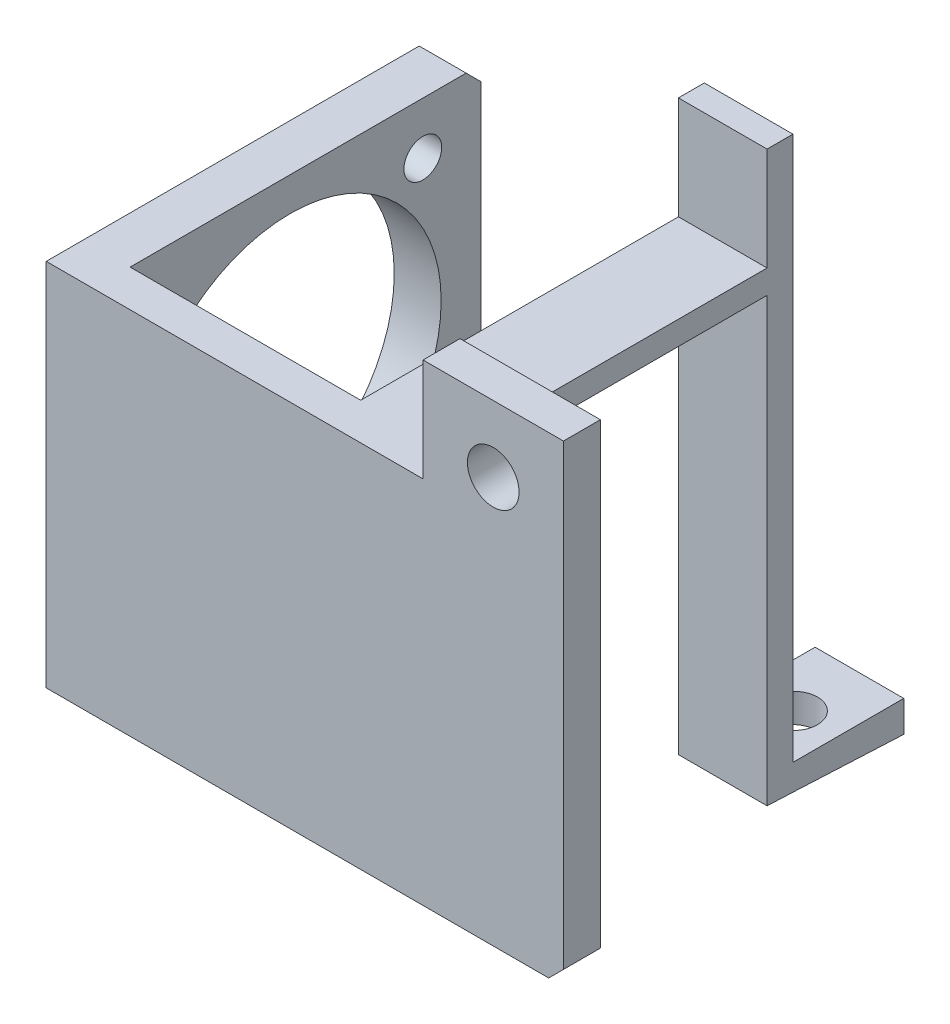
ISO-10303-21;
HEADER;
FILE_DESCRIPTION(('STEP AP214'),'2;1');
FILE_NAME('part.step','',(''),(''),'','','');
FILE_SCHEMA(('AUTOMOTIVE_DESIGN { 1 0 10303 214 1 1 1 1 }'));
ENDSEC;
DATA;
#1=APPLICATION_CONTEXT('core data for automotive mechanical design processes');
#2=APPLICATION_PROTOCOL_DEFINITION('international standard','automotive_design',2000,#1);
#3=PRODUCT_CONTEXT('',#1,'mechanical');
#4=PRODUCT('Part','Part','',(#3));
#5=PRODUCT_RELATED_PRODUCT_CATEGORY('part','',(#4));
#6=PRODUCT_DEFINITION_FORMATION('','',#4);
#7=PRODUCT_DEFINITION_CONTEXT('part definition',#1,'design');
#8=PRODUCT_DEFINITION('design','',#6,#7);
#9=PRODUCT_DEFINITION_SHAPE('','',#8);
#10=(LENGTH_UNIT() NAMED_UNIT(*) SI_UNIT(.MILLI.,.METRE.));
#11=(NAMED_UNIT(*) PLANE_ANGLE_UNIT() SI_UNIT($,.RADIAN.));
#12=(NAMED_UNIT(*) SI_UNIT($,.STERADIAN.) SOLID_ANGLE_UNIT());
#13=UNCERTAINTY_MEASURE_WITH_UNIT(LENGTH_MEASURE(1.E-05),#10,'distance_accuracy_value','');
#14=(GEOMETRIC_REPRESENTATION_CONTEXT(3) GLOBAL_UNCERTAINTY_ASSIGNED_CONTEXT((#13)) GLOBAL_UNIT_ASSIGNED_CONTEXT((#10,
#11,#12)) REPRESENTATION_CONTEXT('',''));
#15=CARTESIAN_POINT('',(0.,0.,0.));
#16=DIRECTION('',(0.,0.,1.));
#17=DIRECTION('',(1.,0.,0.));
#18=AXIS2_PLACEMENT_3D('',#15,#16,#17);
#19=CARTESIAN_POINT('',(51.,-27.8779702218171,5.));
#20=DIRECTION('',(0.,1.,0.));
#21=DIRECTION('',(-1.,0.,0.));
#22=AXIS2_PLACEMENT_3D('',#19,#20,#21);
#23=PLANE('',#22);
#24=DIRECTION('',(0.,0.,1.));
#25=VECTOR('',#24,1.);
#26=CARTESIAN_POINT('',(6.35,-27.8779702218171,-52.48));
#27=LINE('',#26,#25);
#28=CARTESIAN_POINT('',(6.35,-27.8779702218171,-45.48));
#29=VERTEX_POINT('',#28);
#30=CARTESIAN_POINT('',(6.35000000000001,-27.8779702218171,0.));
#31=VERTEX_POINT('',#30);
#32=EDGE_CURVE('E310',#29,#31,#27,.T.);
#33=ORIENTED_EDGE('',*,*,#32,.F.);
#34=DIRECTION('',(-1.,0.,0.));
#35=VECTOR('',#34,1.);
#36=CARTESIAN_POINT('',(51.,-27.8779702218171,-45.48));
#37=LINE('',#36,#35);
#38=CARTESIAN_POINT('',(0.,-27.8779702218171,-45.48));
#39=VERTEX_POINT('',#38);
#40=EDGE_CURVE('E246',#29,#39,#37,.T.);
#41=ORIENTED_EDGE('',*,*,#40,.T.);
#42=DIRECTION('',(0.,0.,-1.));
#43=VECTOR('',#42,1.);
#44=CARTESIAN_POINT('',(0.,-27.8779702218171,5.));
#45=LINE('',#44,#43);
#46=CARTESIAN_POINT('',(0.,-27.8779702218171,5.));
#47=VERTEX_POINT('',#46);
#48=EDGE_CURVE('E333',#47,#39,#45,.T.);
#49=ORIENTED_EDGE('',*,*,#48,.F.);
#50=DIRECTION('',(1.,0.,0.));
#51=VECTOR('',#50,1.);
#52=CARTESIAN_POINT('',(51.,-27.8779702218171,5.));
#53=LINE('',#52,#51);
#54=CARTESIAN_POINT('',(51.,-27.8779702218171,5.));
#55=VERTEX_POINT('',#54);
#56=EDGE_CURVE('E313',#47,#55,#53,.T.);
#57=ORIENTED_EDGE('',*,*,#56,.T.);
#58=DIRECTION('',(0.,0.,-1.));
#59=VECTOR('',#58,1.);
#60=CARTESIAN_POINT('',(51.,-27.8779702218171,5.));
#61=LINE('',#60,#59);
#62=CARTESIAN_POINT('',(51.,-27.8779702218171,0.));
#63=VERTEX_POINT('',#62);
#64=EDGE_CURVE('E322',#55,#63,#61,.T.);
#65=ORIENTED_EDGE('',*,*,#64,.T.);
#66=DIRECTION('',(1.,0.,0.));
#67=VECTOR('',#66,1.);
#68=CARTESIAN_POINT('',(51.,-27.8779702218171,0.));
#69=LINE('',#68,#67);
#70=CARTESIAN_POINT('',(49.56,-27.8779702218171,0.));
#71=VERTEX_POINT('',#70);
#72=EDGE_CURVE('E312',#71,#63,#69,.T.);
#73=ORIENTED_EDGE('',*,*,#72,.F.);
#74=DIRECTION('',(0.,0.,1.));
#75=VECTOR('',#74,1.);
#76=CARTESIAN_POINT('',(49.56,-27.8779702218171,-46.5));
#77=LINE('',#76,#75);
#78=CARTESIAN_POINT('',(49.56,-27.8779702218171,-43.));
#79=VERTEX_POINT('',#78);
#80=EDGE_CURVE('E272',#79,#71,#77,.T.);
#81=ORIENTED_EDGE('',*,*,#80,.F.);
#82=DIRECTION('',(-1.,0.,0.));
#83=VECTOR('',#82,1.);
#84=CARTESIAN_POINT('',(51.,-27.8779702218171,-43.));
#85=LINE('',#84,#83);
#86=CARTESIAN_POINT('',(37.56,-27.8779702218171,-43.));
#87=VERTEX_POINT('',#86);
#88=EDGE_CURVE('E391',#79,#87,#85,.T.);
#89=ORIENTED_EDGE('',*,*,#88,.T.);
#90=DIRECTION('',(0.,0.,1.));
#91=VECTOR('',#90,1.);
#92=CARTESIAN_POINT('',(37.56,-27.8779702218171,-46.5));
#93=LINE('',#92,#91);
#94=CARTESIAN_POINT('',(37.56,-27.8779702218171,0.));
#95=VERTEX_POINT('',#94);
#96=EDGE_CURVE('E268',#87,#95,#93,.T.);
#97=ORIENTED_EDGE('',*,*,#96,.T.);
#98=EDGE_CURVE('E323',#31,#95,#69,.T.);
#99=ORIENTED_EDGE('',*,*,#98,.F.);
#100=EDGE_LOOP('',(#33,#41,#49,#57,#65,#73,#81,#89,#97,#99));
#101=FACE_BOUND('',#100,.T.);
#102=ADVANCED_FACE('F43',(#101),#23,.T.);
#103=CARTESIAN_POINT('',(0.,0.,0.));
#104=DIRECTION('',(0.,0.,-1.));
#105=DIRECTION('',(-1.,0.,0.));
#106=AXIS2_PLACEMENT_3D('',#103,#104,#105);
#107=PLANE('',#106);
#108=DIRECTION('',(-1.,0.,0.));
#109=VECTOR('',#108,1.);
#110=CARTESIAN_POINT('',(0.,-13.9389851109086,0.));
#111=LINE('',#110,#109);
#112=CARTESIAN_POINT('',(70.,-13.9389851109086,0.));
#113=VERTEX_POINT('',#112);
#114=CARTESIAN_POINT('',(51.,-13.9389851109085,0.));
#115=VERTEX_POINT('',#114);
#116=EDGE_CURVE('E59',#113,#115,#111,.T.);
#117=ORIENTED_EDGE('',*,*,#116,.F.);
#118=DIRECTION('',(0.,1.,0.));
#119=VECTOR('',#118,1.);
#120=CARTESIAN_POINT('',(70.,64.0610148890915,0.));
#121=LINE('',#120,#119);
#122=CARTESIAN_POINT('',(70.,-75.8779702218171,0.));
#123=VERTEX_POINT('',#122);
#124=EDGE_CURVE('E207',#123,#113,#121,.T.);
#125=ORIENTED_EDGE('',*,*,#124,.F.);
#126=DIRECTION('',(-0.707106781186548,-0.707106781186548,0.));
#127=VECTOR('',#126,1.);
#128=CARTESIAN_POINT('',(72.9389851109086,-72.9389851109086,0.));
#129=LINE('',#128,#127);
#130=CARTESIAN_POINT('',(68.0000000000001,-77.8779702218171,0.));
#131=VERTEX_POINT('',#130);
#132=EDGE_CURVE('E217',#123,#131,#129,.T.);
#133=ORIENTED_EDGE('',*,*,#132,.T.);
#134=DIRECTION('',(-1.,0.,0.));
#135=VECTOR('',#134,1.);
#136=CARTESIAN_POINT('',(0.,-77.8779702218171,0.));
#137=LINE('',#136,#135);
#138=CARTESIAN_POINT('',(6.35000000000001,-77.8779702218171,0.));
#139=VERTEX_POINT('',#138);
#140=EDGE_CURVE('E317',#131,#139,#137,.T.);
#141=ORIENTED_EDGE('',*,*,#140,.T.);
#142=DIRECTION('',(0.,1.,0.));
#143=VECTOR('',#142,1.);
#144=CARTESIAN_POINT('',(6.35,-27.8779702218171,0.));
#145=LINE('',#144,#143);
#146=EDGE_CURVE('E305',#139,#31,#145,.T.);
#147=ORIENTED_EDGE('',*,*,#146,.T.);
#148=ORIENTED_EDGE('',*,*,#98,.T.);
#149=DIRECTION('',(0.,-1.,0.));
#150=VECTOR('',#149,1.);
#151=CARTESIAN_POINT('',(37.56,-27.8779702218171,0.));
#152=LINE('',#151,#150);
#153=CARTESIAN_POINT('',(37.56,-31.0779702218171,0.));
#154=VERTEX_POINT('',#153);
#155=EDGE_CURVE('E399',#95,#154,#152,.T.);
#156=ORIENTED_EDGE('',*,*,#155,.T.);
#157=DIRECTION('',(1.,0.,0.));
#158=VECTOR('',#157,1.);
#159=CARTESIAN_POINT('',(49.56,-31.0779702218171,0.));
#160=LINE('',#159,#158);
#161=CARTESIAN_POINT('',(49.56,-31.0779702218171,0.));
#162=VERTEX_POINT('',#161);
#163=EDGE_CURVE('E263',#154,#162,#160,.T.);
#164=ORIENTED_EDGE('',*,*,#163,.T.);
#165=DIRECTION('',(0.,1.,0.));
#166=VECTOR('',#165,1.);
#167=CARTESIAN_POINT('',(49.56,-27.8779702218171,0.));
#168=LINE('',#167,#166);
#169=EDGE_CURVE('E395',#162,#71,#168,.T.);
#170=ORIENTED_EDGE('',*,*,#169,.T.);
#171=ORIENTED_EDGE('',*,*,#72,.T.);
#172=DIRECTION('',(0.,-1.,0.));
#173=VECTOR('',#172,1.);
#174=CARTESIAN_POINT('',(51.,-13.9389851109085,0.));
#175=LINE('',#174,#173);
#176=EDGE_CURVE('E222',#115,#63,#175,.T.);
#177=ORIENTED_EDGE('',*,*,#176,.F.);
#178=EDGE_LOOP('',(#117,#125,#133,#141,#147,#148,#156,#164,#170,#171,#177));
#179=FACE_BOUND('',#178,.T.);
#180=CARTESIAN_POINT('',(60.5,-22.9389851109085,0.));
#181=DIRECTION('',(0.,0.,1.));
#182=DIRECTION('',(-1.,0.,0.));
#183=AXIS2_PLACEMENT_3D('',#180,#181,#182);
#184=CIRCLE('',#183,3.5);
#185=CARTESIAN_POINT('',(57.,-22.9389851109085,0.));
#186=VERTEX_POINT('',#185);
#187=EDGE_CURVE('E276',#186,#186,#184,.T.);
#188=ORIENTED_EDGE('',*,*,#187,.T.);
#189=EDGE_LOOP('',(#188));
#190=FACE_BOUND('',#189,.T.);
#191=ADVANCED_FACE('F414',(#179,#190),#107,.T.);
#192=CARTESIAN_POINT('',(70.,64.0610148890915,5.));
#193=DIRECTION('',(-1.,0.,0.));
#194=DIRECTION('',(0.,-1.,0.));
#195=AXIS2_PLACEMENT_3D('',#192,#193,#194);
#196=PLANE('',#195);
#197=ORIENTED_EDGE('',*,*,#124,.T.);
#198=DIRECTION('',(0.,0.,-1.));
#199=VECTOR('',#198,1.);
#200=CARTESIAN_POINT('',(70.,-13.9389851109086,5.));
#201=LINE('',#200,#199);
#202=CARTESIAN_POINT('',(70.,-13.9389851109086,5.));
#203=VERTEX_POINT('',#202);
#204=EDGE_CURVE('E193',#203,#113,#201,.T.);
#205=ORIENTED_EDGE('',*,*,#204,.F.);
#206=DIRECTION('',(0.,1.,0.));
#207=VECTOR('',#206,1.);
#208=CARTESIAN_POINT('',(70.,64.0610148890915,5.));
#209=LINE('',#208,#207);
#210=CARTESIAN_POINT('',(70.,-75.8779702218171,5.));
#211=VERTEX_POINT('',#210);
#212=EDGE_CURVE('E204',#211,#203,#209,.T.);
#213=ORIENTED_EDGE('',*,*,#212,.F.);
#214=DIRECTION('',(0.,0.,-1.));
#215=VECTOR('',#214,1.);
#216=CARTESIAN_POINT('',(70.,-75.8779702218171,0.));
#217=LINE('',#216,#215);
#218=EDGE_CURVE('E214',#211,#123,#217,.T.);
#219=ORIENTED_EDGE('',*,*,#218,.T.);
#220=EDGE_LOOP('',(#197,#205,#213,#219));
#221=FACE_BOUND('',#220,.T.);
#222=ADVANCED_FACE('F202',(#221),#196,.F.);
#223=CARTESIAN_POINT('',(0.,0.,5.));
#224=DIRECTION('',(0.,0.,-1.));
#225=DIRECTION('',(-1.,0.,0.));
#226=AXIS2_PLACEMENT_3D('',#223,#224,#225);
#227=PLANE('',#226);
#228=CARTESIAN_POINT('',(60.5,-22.9389851109085,5.));
#229=DIRECTION('',(0.,0.,-1.));
#230=DIRECTION('',(-1.,0.,0.));
#231=AXIS2_PLACEMENT_3D('',#228,#229,#230);
#232=CIRCLE('',#231,3.5);
#233=CARTESIAN_POINT('',(57.,-22.9389851109085,5.));
#234=VERTEX_POINT('',#233);
#235=EDGE_CURVE('E270',#234,#234,#232,.T.);
#236=ORIENTED_EDGE('',*,*,#235,.T.);
#237=EDGE_LOOP('',(#236));
#238=FACE_BOUND('',#237,.T.);
#239=ORIENTED_EDGE('',*,*,#212,.T.);
#240=DIRECTION('',(1.,0.,0.));
#241=VECTOR('',#240,1.);
#242=CARTESIAN_POINT('',(-159.731110219777,-13.9389851109086,5.));
#243=LINE('',#242,#241);
#244=CARTESIAN_POINT('',(51.,-13.9389851109086,5.));
#245=VERTEX_POINT('',#244);
#246=EDGE_CURVE('E190',#245,#203,#243,.T.);
#247=ORIENTED_EDGE('',*,*,#246,.F.);
#248=DIRECTION('',(0.,-1.,0.));
#249=VECTOR('',#248,1.);
#250=CARTESIAN_POINT('',(51.,-13.9389851109085,5.));
#251=LINE('',#250,#249);
#252=EDGE_CURVE('E215',#245,#55,#251,.T.);
#253=ORIENTED_EDGE('',*,*,#252,.T.);
#254=ORIENTED_EDGE('',*,*,#56,.F.);
#255=DIRECTION('',(0.,1.,0.));
#256=VECTOR('',#255,1.);
#257=CARTESIAN_POINT('',(0.,-27.8779702218171,5.));
#258=LINE('',#257,#256);
#259=CARTESIAN_POINT('',(0.,-77.8779702218171,5.));
#260=VERTEX_POINT('',#259);
#261=EDGE_CURVE('E316',#260,#47,#258,.T.);
#262=ORIENTED_EDGE('',*,*,#261,.F.);
#263=DIRECTION('',(-1.,0.,0.));
#264=VECTOR('',#263,1.);
#265=CARTESIAN_POINT('',(0.,-77.8779702218171,5.));
#266=LINE('',#265,#264);
#267=CARTESIAN_POINT('',(68.0000000000001,-77.8779702218171,5.));
#268=VERTEX_POINT('',#267);
#269=EDGE_CURVE('E320',#268,#260,#266,.T.);
#270=ORIENTED_EDGE('',*,*,#269,.F.);
#271=DIRECTION('',(0.707106781186548,0.707106781186548,0.));
#272=VECTOR('',#271,1.);
#273=CARTESIAN_POINT('',(70.,-75.8779702218171,5.));
#274=LINE('',#273,#272);
#275=EDGE_CURVE('E213',#268,#211,#274,.T.);
#276=ORIENTED_EDGE('',*,*,#275,.T.);
#277=EDGE_LOOP('',(#239,#247,#253,#254,#262,#270,#276));
#278=FACE_BOUND('',#277,.T.);
#279=ADVANCED_FACE('F210',(#238,#278),#227,.F.);
#280=CARTESIAN_POINT('',(0.,-77.8779702218171,5.));
#281=DIRECTION('',(0.,-1.,0.));
#282=DIRECTION('',(1.,0.,0.));
#283=AXIS2_PLACEMENT_3D('',#280,#281,#282);
#284=PLANE('',#283);
#285=ORIENTED_EDGE('',*,*,#140,.F.);
#286=DIRECTION('',(0.,0.,1.));
#287=VECTOR('',#286,1.);
#288=CARTESIAN_POINT('',(68.0000000000001,-77.8779702218171,5.));
#289=LINE('',#288,#287);
#290=EDGE_CURVE('E230',#131,#268,#289,.T.);
#291=ORIENTED_EDGE('',*,*,#290,.T.);
#292=ORIENTED_EDGE('',*,*,#269,.T.);
#293=DIRECTION('',(0.,0.,-1.));
#294=VECTOR('',#293,1.);
#295=CARTESIAN_POINT('',(0.,-77.8779702218171,5.));
#296=LINE('',#295,#294);
#297=CARTESIAN_POINT('',(0.,-77.8779702218171,-45.48));
#298=VERTEX_POINT('',#297);
#299=EDGE_CURVE('E330',#260,#298,#296,.T.);
#300=ORIENTED_EDGE('',*,*,#299,.T.);
#301=DIRECTION('',(1.,0.,0.));
#302=VECTOR('',#301,1.);
#303=CARTESIAN_POINT('',(0.,-77.8779702218171,-45.48));
#304=LINE('',#303,#302);
#305=CARTESIAN_POINT('',(6.35000000000001,-77.8779702218171,-45.48));
#306=VERTEX_POINT('',#305);
#307=EDGE_CURVE('E227',#298,#306,#304,.T.);
#308=ORIENTED_EDGE('',*,*,#307,.T.);
#309=DIRECTION('',(0.,0.,1.));
#310=VECTOR('',#309,1.);
#311=CARTESIAN_POINT('',(6.35000000000001,-77.8779702218171,-52.48));
#312=LINE('',#311,#310);
#313=EDGE_CURVE('E308',#306,#139,#312,.T.);
#314=ORIENTED_EDGE('',*,*,#313,.T.);
#315=EDGE_LOOP('',(#285,#291,#292,#300,#308,#314));
#316=FACE_BOUND('',#315,.T.);
#317=ADVANCED_FACE('F432',(#316),#284,.T.);
#318=CARTESIAN_POINT('',(0.,0.,-46.5));
#319=DIRECTION('',(0.,0.,1.));
#320=DIRECTION('',(1.,0.,0.));
#321=AXIS2_PLACEMENT_3D('',#318,#319,#320);
#322=PLANE('',#321);
#323=DIRECTION('',(0.,1.,0.));
#324=VECTOR('',#323,1.);
#325=CARTESIAN_POINT('',(37.56,0.,-46.5));
#326=LINE('',#325,#324);
#327=CARTESIAN_POINT('',(37.56,-87.5746130747018,-46.5));
#328=VERTEX_POINT('',#327);
#329=CARTESIAN_POINT('',(37.56,-13.9389851109086,-46.5));
#330=VERTEX_POINT('',#329);
#331=EDGE_CURVE('E224',#328,#330,#326,.T.);
#332=ORIENTED_EDGE('',*,*,#331,.T.);
#333=DIRECTION('',(1.,0.,0.));
#334=VECTOR('',#333,1.);
#335=CARTESIAN_POINT('',(0.,-13.9389851109086,-46.5));
#336=LINE('',#335,#334);
#337=CARTESIAN_POINT('',(49.56,-13.9389851109086,-46.5));
#338=VERTEX_POINT('',#337);
#339=EDGE_CURVE('E342',#330,#338,#336,.T.);
#340=ORIENTED_EDGE('',*,*,#339,.T.);
#341=DIRECTION('',(0.,-1.,0.));
#342=VECTOR('',#341,1.);
#343=CARTESIAN_POINT('',(49.56,0.,-46.5));
#344=LINE('',#343,#342);
#345=CARTESIAN_POINT('',(49.5599999999998,-87.5746130747019,-46.5));
#346=VERTEX_POINT('',#345);
#347=EDGE_CURVE('E336',#338,#346,#344,.T.);
#348=ORIENTED_EDGE('',*,*,#347,.T.);
#349=DIRECTION('',(1.,0.,0.));
#350=VECTOR('',#349,1.);
#351=CARTESIAN_POINT('',(-42.4634266051924,-87.5746130747017,-46.5));
#352=LINE('',#351,#350);
#353=EDGE_CURVE('E345',#328,#346,#352,.T.);
#354=ORIENTED_EDGE('',*,*,#353,.F.);
#355=EDGE_LOOP('',(#332,#340,#348,#354));
#356=FACE_BOUND('',#355,.T.);
#357=ADVANCED_FACE('F341',(#356),#322,.F.);
#358=CARTESIAN_POINT('',(51.,-13.9389851109085,5.));
#359=DIRECTION('',(1.,0.,0.));
#360=DIRECTION('',(0.,0.,-1.));
#361=AXIS2_PLACEMENT_3D('',#358,#359,#360);
#362=PLANE('',#361);
#363=ORIENTED_EDGE('',*,*,#252,.F.);
#364=DIRECTION('',(0.,0.,-1.));
#365=VECTOR('',#364,1.);
#366=CARTESIAN_POINT('',(51.,-13.9389851109085,5.));
#367=LINE('',#366,#365);
#368=EDGE_CURVE('E194',#245,#115,#367,.T.);
#369=ORIENTED_EDGE('',*,*,#368,.T.);
#370=ORIENTED_EDGE('',*,*,#176,.T.);
#371=ORIENTED_EDGE('',*,*,#64,.F.);
#372=EDGE_LOOP('',(#363,#369,#370,#371));
#373=FACE_BOUND('',#372,.T.);
#374=ADVANCED_FACE('F426',(#373),#362,.F.);
#375=CARTESIAN_POINT('',(49.56,0.,-46.5));
#376=DIRECTION('',(-1.,0.,0.));
#377=DIRECTION('',(0.,-1.,0.));
#378=AXIS2_PLACEMENT_3D('',#375,#376,#377);
#379=PLANE('',#378);
#380=ORIENTED_EDGE('',*,*,#347,.F.);
#381=DIRECTION('',(0.,0.,1.));
#382=VECTOR('',#381,1.);
#383=CARTESIAN_POINT('',(49.56,-13.9389851109086,-46.5));
#384=LINE('',#383,#382);
#385=CARTESIAN_POINT('',(49.56,-13.9389851109086,-43.));
#386=VERTEX_POINT('',#385);
#387=EDGE_CURVE('E421',#338,#386,#384,.T.);
#388=ORIENTED_EDGE('',*,*,#387,.T.);
#389=DIRECTION('',(0.,-1.,0.));
#390=VECTOR('',#389,1.);
#391=CARTESIAN_POINT('',(49.56,75.6254310840446,-43.));
#392=LINE('',#391,#390);
#393=EDGE_CURVE('E388',#386,#79,#392,.T.);
#394=ORIENTED_EDGE('',*,*,#393,.T.);
#395=ORIENTED_EDGE('',*,*,#80,.T.);
#396=ORIENTED_EDGE('',*,*,#169,.F.);
#397=DIRECTION('',(0.,0.,1.));
#398=VECTOR('',#397,1.);
#399=CARTESIAN_POINT('',(49.56,-31.0779702218171,-46.5));
#400=LINE('',#399,#398);
#401=CARTESIAN_POINT('',(49.5599999999999,-31.0779702218171,-43.));
#402=VERTEX_POINT('',#401);
#403=EDGE_CURVE('E267',#402,#162,#400,.T.);
#404=ORIENTED_EDGE('',*,*,#403,.F.);
#405=DIRECTION('',(0.,-1.,0.));
#406=VECTOR('',#405,1.);
#407=CARTESIAN_POINT('',(49.5599999999998,-90.9199987527818,-43.));
#408=LINE('',#407,#406);
#409=CARTESIAN_POINT('',(49.5599999999998,-90.9199987527818,-43.));
#410=VERTEX_POINT('',#409);
#411=EDGE_CURVE('E256',#402,#410,#408,.T.);
#412=ORIENTED_EDGE('',*,*,#411,.T.);
#413=DIRECTION('',(0.,-0.0441324797854622,-0.999025687471541));
#414=VECTOR('',#413,1.);
#415=CARTESIAN_POINT('',(49.5599999999998,-90.9199987527818,-43.));
#416=LINE('',#415,#414);
#417=CARTESIAN_POINT('',(49.5599999999998,-91.0746130747019,-46.5));
#418=VERTEX_POINT('',#417);
#419=EDGE_CURVE('E379',#410,#418,#416,.T.);
#420=ORIENTED_EDGE('',*,*,#419,.T.);
#421=DIRECTION('',(0.,-0.0479447993683981,-0.99884998684163));
#422=VECTOR('',#421,1.);
#423=CARTESIAN_POINT('',(49.5599999999998,-91.0746130747019,-46.5));
#424=LINE('',#423,#422);
#425=CARTESIAN_POINT('',(49.5599999999998,-91.7946130747019,-61.5));
#426=VERTEX_POINT('',#425);
#427=EDGE_CURVE('E370',#418,#426,#424,.T.);
#428=ORIENTED_EDGE('',*,*,#427,.T.);
#429=DIRECTION('',(0.,1.,0.));
#430=VECTOR('',#429,1.);
#431=CARTESIAN_POINT('',(49.5599999999998,-91.7946130747019,-61.5));
#432=LINE('',#431,#430);
#433=CARTESIAN_POINT('',(49.5599999999998,-87.5746130747019,-61.5));
#434=VERTEX_POINT('',#433);
#435=EDGE_CURVE('E373',#426,#434,#432,.T.);
#436=ORIENTED_EDGE('',*,*,#435,.T.);
#437=DIRECTION('',(0.,0.,1.));
#438=VECTOR('',#437,1.);
#439=CARTESIAN_POINT('',(49.5599999999998,-87.5746130747019,-61.5));
#440=LINE('',#439,#438);
#441=EDGE_CURVE('E376',#434,#346,#440,.T.);
#442=ORIENTED_EDGE('',*,*,#441,.T.);
#443=EDGE_LOOP('',(#380,#388,#394,#395,#396,#404,#412,#420,#428,#436,#442));
#444=FACE_BOUND('',#443,.T.);
#445=ADVANCED_FACE('F404',(#444),#379,.F.);
#446=CARTESIAN_POINT('',(37.56,0.,-46.5));
#447=DIRECTION('',(1.,0.,0.));
#448=DIRECTION('',(0.,0.,-1.));
#449=AXIS2_PLACEMENT_3D('',#446,#447,#448);
#450=PLANE('',#449);
#451=DIRECTION('',(0.,-1.,0.));
#452=VECTOR('',#451,1.);
#453=CARTESIAN_POINT('',(37.56,75.6254310840446,-43.));
#454=LINE('',#453,#452);
#455=CARTESIAN_POINT('',(37.56,-13.9389851109086,-43.));
#456=VERTEX_POINT('',#455);
#457=EDGE_CURVE('E389',#456,#87,#454,.T.);
#458=ORIENTED_EDGE('',*,*,#457,.F.);
#459=DIRECTION('',(0.,0.,-1.));
#460=VECTOR('',#459,1.);
#461=CARTESIAN_POINT('',(37.56,-13.9389851109086,-46.5));
#462=LINE('',#461,#460);
#463=EDGE_CURVE('E67',#456,#330,#462,.T.);
#464=ORIENTED_EDGE('',*,*,#463,.T.);
#465=ORIENTED_EDGE('',*,*,#331,.F.);
#466=DIRECTION('',(0.,0.,-1.));
#467=VECTOR('',#466,1.);
#468=CARTESIAN_POINT('',(37.56,-87.5746130747018,-61.5));
#469=LINE('',#468,#467);
#470=CARTESIAN_POINT('',(37.56,-87.5746130747018,-61.5));
#471=VERTEX_POINT('',#470);
#472=EDGE_CURVE('E349',#328,#471,#469,.T.);
#473=ORIENTED_EDGE('',*,*,#472,.T.);
#474=DIRECTION('',(0.,-1.,0.));
#475=VECTOR('',#474,1.);
#476=CARTESIAN_POINT('',(37.56,-91.7946130747017,-61.5));
#477=LINE('',#476,#475);
#478=CARTESIAN_POINT('',(37.56,-91.7946130747019,-61.5));
#479=VERTEX_POINT('',#478);
#480=EDGE_CURVE('E369',#471,#479,#477,.T.);
#481=ORIENTED_EDGE('',*,*,#480,.T.);
#482=DIRECTION('',(0.,0.0479447993683981,0.99884998684163));
#483=VECTOR('',#482,1.);
#484=CARTESIAN_POINT('',(37.56,-91.0746130747019,-46.5));
#485=LINE('',#484,#483);
#486=CARTESIAN_POINT('',(37.56,-91.0746130747019,-46.5));
#487=VERTEX_POINT('',#486);
#488=EDGE_CURVE('E367',#479,#487,#485,.T.);
#489=ORIENTED_EDGE('',*,*,#488,.T.);
#490=DIRECTION('',(0.,0.0441324797854622,0.999025687471541));
#491=VECTOR('',#490,1.);
#492=CARTESIAN_POINT('',(37.56,-90.9199987527818,-43.));
#493=LINE('',#492,#491);
#494=CARTESIAN_POINT('',(37.56,-90.9199987527818,-43.));
#495=VERTEX_POINT('',#494);
#496=EDGE_CURVE('E359',#487,#495,#493,.T.);
#497=ORIENTED_EDGE('',*,*,#496,.T.);
#498=DIRECTION('',(0.,1.,0.));
#499=VECTOR('',#498,1.);
#500=CARTESIAN_POINT('',(37.56,-90.9199987527816,-43.));
#501=LINE('',#500,#499);
#502=CARTESIAN_POINT('',(37.56,-31.0779702218171,-43.));
#503=VERTEX_POINT('',#502);
#504=EDGE_CURVE('E254',#495,#503,#501,.T.);
#505=ORIENTED_EDGE('',*,*,#504,.T.);
#506=DIRECTION('',(0.,0.,1.));
#507=VECTOR('',#506,1.);
#508=CARTESIAN_POINT('',(37.56,-31.0779702218171,-46.5));
#509=LINE('',#508,#507);
#510=EDGE_CURVE('E260',#503,#154,#509,.T.);
#511=ORIENTED_EDGE('',*,*,#510,.T.);
#512=ORIENTED_EDGE('',*,*,#155,.F.);
#513=ORIENTED_EDGE('',*,*,#96,.F.);
#514=EDGE_LOOP('',(#458,#464,#465,#473,#481,#489,#497,#505,#511,#512,#513));
#515=FACE_BOUND('',#514,.T.);
#516=ADVANCED_FACE('F348',(#515),#450,.F.);
#517=CARTESIAN_POINT('',(0.,-27.8779702218171,5.));
#518=DIRECTION('',(-1.,0.,0.));
#519=DIRECTION('',(0.,-1.,0.));
#520=AXIS2_PLACEMENT_3D('',#517,#518,#519);
#521=PLANE('',#520);
#522=CARTESIAN_POINT('',(0.,-34.9229702218171,-39.615));
#523=DIRECTION('',(-1.,0.,0.));
#524=DIRECTION('',(0.,-1.,0.));
#525=AXIS2_PLACEMENT_3D('',#522,#523,#524);
#526=CIRCLE('',#525,2.555);
#527=CARTESIAN_POINT('',(0.,-37.4779702218171,-39.615));
#528=VERTEX_POINT('',#527);
#529=EDGE_CURVE('E286',#528,#528,#526,.T.);
#530=ORIENTED_EDGE('',*,*,#529,.F.);
#531=EDGE_LOOP('',(#530));
#532=FACE_BOUND('',#531,.T.);
#533=CARTESIAN_POINT('',(0.,-70.8329702218171,-3.695));
#534=DIRECTION('',(-1.,0.,0.));
#535=DIRECTION('',(0.,-1.,0.));
#536=AXIS2_PLACEMENT_3D('',#533,#534,#535);
#537=CIRCLE('',#536,2.555);
#538=CARTESIAN_POINT('',(0.,-73.3879702218171,-3.695));
#539=VERTEX_POINT('',#538);
#540=EDGE_CURVE('E285',#539,#539,#537,.T.);
#541=ORIENTED_EDGE('',*,*,#540,.F.);
#542=EDGE_LOOP('',(#541));
#543=FACE_BOUND('',#542,.T.);
#544=CARTESIAN_POINT('',(0.,-52.8779702218171,-21.66));
#545=DIRECTION('',(-1.,0.,0.));
#546=DIRECTION('',(0.,-1.,0.));
#547=AXIS2_PLACEMENT_3D('',#544,#545,#546);
#548=CIRCLE('',#547,20.44);
#549=CARTESIAN_POINT('',(0.,-73.3179702218171,-21.66));
#550=VERTEX_POINT('',#549);
#551=EDGE_CURVE('E302',#550,#550,#548,.T.);
#552=ORIENTED_EDGE('',*,*,#551,.F.);
#553=EDGE_LOOP('',(#552));
#554=FACE_BOUND('',#553,.T.);
#555=DIRECTION('',(0.,1.,0.));
#556=VECTOR('',#555,1.);
#557=CARTESIAN_POINT('',(0.,-77.8779702218171,-47.48));
#558=LINE('',#557,#556);
#559=CARTESIAN_POINT('',(0.,-75.8779702218171,-47.48));
#560=VERTEX_POINT('',#559);
#561=CARTESIAN_POINT('',(0.,-29.8779702218171,-47.48));
#562=VERTEX_POINT('',#561);
#563=EDGE_CURVE('E279',#560,#562,#558,.T.);
#564=ORIENTED_EDGE('',*,*,#563,.F.);
#565=DIRECTION('',(0.,0.707106781186543,-0.707106781186552));
#566=VECTOR('',#565,1.);
#567=CARTESIAN_POINT('',(0.,-78.1179702218174,-45.2399999999996));
#568=LINE('',#567,#566);
#569=EDGE_CURVE('E244',#560,#298,#568,.F.);
#570=ORIENTED_EDGE('',*,*,#569,.T.);
#571=ORIENTED_EDGE('',*,*,#299,.F.);
#572=ORIENTED_EDGE('',*,*,#261,.T.);
#573=ORIENTED_EDGE('',*,*,#48,.T.);
#574=DIRECTION('',(0.,0.707106781186551,0.707106781186545));
#575=VECTOR('',#574,1.);
#576=CARTESIAN_POINT('',(0.,-2.63797022181707,-20.2400000000002));
#577=LINE('',#576,#575);
#578=EDGE_CURVE('E242',#39,#562,#577,.F.);
#579=ORIENTED_EDGE('',*,*,#578,.T.);
#580=EDGE_LOOP('',(#564,#570,#571,#572,#573,#579));
#581=FACE_BOUND('',#580,.T.);
#582=ADVANCED_FACE('F454',(#532,#543,#554,#581),#521,.T.);
#583=CARTESIAN_POINT('',(6.35,-27.8779702218171,-52.48));
#584=DIRECTION('',(1.,0.,0.));
#585=DIRECTION('',(0.,1.,0.));
#586=AXIS2_PLACEMENT_3D('',#583,#584,#585);
#587=PLANE('',#586);
#588=CARTESIAN_POINT('',(6.35,-34.9229702218171,-39.615));
#589=DIRECTION('',(-1.,0.,0.));
#590=DIRECTION('',(0.,0.,-1.));
#591=AXIS2_PLACEMENT_3D('',#588,#589,#590);
#592=CIRCLE('',#591,2.555);
#593=CARTESIAN_POINT('',(6.35,-34.9229702218171,-42.17));
#594=VERTEX_POINT('',#593);
#595=EDGE_CURVE('E290',#594,#594,#592,.T.);
#596=ORIENTED_EDGE('',*,*,#595,.T.);
#597=EDGE_LOOP('',(#596));
#598=FACE_BOUND('',#597,.T.);
#599=CARTESIAN_POINT('',(6.35000000000001,-70.8329702218171,-3.695));
#600=DIRECTION('',(-1.,0.,0.));
#601=DIRECTION('',(0.,0.,-1.));
#602=AXIS2_PLACEMENT_3D('',#599,#600,#601);
#603=CIRCLE('',#602,2.555);
#604=CARTESIAN_POINT('',(6.35000000000001,-70.8329702218171,-6.24999999999999));
#605=VERTEX_POINT('',#604);
#606=EDGE_CURVE('E282',#605,#605,#603,.T.);
#607=ORIENTED_EDGE('',*,*,#606,.T.);
#608=EDGE_LOOP('',(#607));
#609=FACE_BOUND('',#608,.T.);
#610=CARTESIAN_POINT('',(6.35000000000001,-52.8779702218171,-21.66));
#611=DIRECTION('',(-1.,0.,0.));
#612=DIRECTION('',(0.,0.,-1.));
#613=AXIS2_PLACEMENT_3D('',#610,#611,#612);
#614=CIRCLE('',#613,20.44);
#615=CARTESIAN_POINT('',(6.35000000000001,-52.8779702218171,-42.1));
#616=VERTEX_POINT('',#615);
#617=EDGE_CURVE('E289',#616,#616,#614,.T.);
#618=ORIENTED_EDGE('',*,*,#617,.T.);
#619=EDGE_LOOP('',(#618));
#620=FACE_BOUND('',#619,.T.);
#621=ORIENTED_EDGE('',*,*,#313,.F.);
#622=DIRECTION('',(0.,-0.707106781186543,0.707106781186552));
#623=VECTOR('',#622,1.);
#624=CARTESIAN_POINT('',(6.35000000000001,-49.3779702218174,-73.98));
#625=LINE('',#624,#623);
#626=CARTESIAN_POINT('',(6.35000000000001,-75.8779702218171,-47.48));
#627=VERTEX_POINT('',#626);
#628=EDGE_CURVE('E235',#306,#627,#625,.F.);
#629=ORIENTED_EDGE('',*,*,#628,.T.);
#630=DIRECTION('',(0.,1.,0.));
#631=VECTOR('',#630,1.);
#632=CARTESIAN_POINT('',(6.35000000000001,-77.8779702218171,-47.48));
#633=LINE('',#632,#631);
#634=CARTESIAN_POINT('',(6.35,-29.8779702218171,-47.48));
#635=VERTEX_POINT('',#634);
#636=EDGE_CURVE('E293',#627,#635,#633,.T.);
#637=ORIENTED_EDGE('',*,*,#636,.T.);
#638=DIRECTION('',(0.,-0.707106781186551,-0.707106781186545));
#639=VECTOR('',#638,1.);
#640=CARTESIAN_POINT('',(6.35,-31.3779702218171,-48.98));
#641=LINE('',#640,#639);
#642=EDGE_CURVE('E233',#635,#29,#641,.F.);
#643=ORIENTED_EDGE('',*,*,#642,.T.);
#644=ORIENTED_EDGE('',*,*,#32,.T.);
#645=ORIENTED_EDGE('',*,*,#146,.F.);
#646=EDGE_LOOP('',(#621,#629,#637,#643,#644,#645));
#647=FACE_BOUND('',#646,.T.);
#648=ADVANCED_FACE('F487',(#598,#609,#620,#647),#587,.T.);
#649=CARTESIAN_POINT('',(-0.00100000000000707,-52.8779702218171,-21.66));
#650=DIRECTION('',(1.,0.,0.));
#651=DIRECTION('',(0.,1.,0.));
#652=AXIS2_PLACEMENT_3D('',#649,#650,#651);
#653=CYLINDRICAL_SURFACE('',#652,20.44);
#654=ORIENTED_EDGE('',*,*,#551,.T.);
#655=EDGE_LOOP('',(#654));
#656=FACE_BOUND('',#655,.T.);
#657=ORIENTED_EDGE('',*,*,#617,.F.);
#658=EDGE_LOOP('',(#657));
#659=FACE_BOUND('',#658,.T.);
#660=ADVANCED_FACE('F495',(#656,#659),#653,.F.);
#661=CARTESIAN_POINT('',(-0.0010000000000036,-70.8329702218171,-3.695));
#662=DIRECTION('',(1.,0.,0.));
#663=DIRECTION('',(0.,1.,0.));
#664=AXIS2_PLACEMENT_3D('',#661,#662,#663);
#665=CYLINDRICAL_SURFACE('',#664,2.555);
#666=ORIENTED_EDGE('',*,*,#540,.T.);
#667=EDGE_LOOP('',(#666));
#668=FACE_BOUND('',#667,.T.);
#669=ORIENTED_EDGE('',*,*,#606,.F.);
#670=EDGE_LOOP('',(#669));
#671=FACE_BOUND('',#670,.T.);
#672=ADVANCED_FACE('F503',(#668,#671),#665,.F.);
#673=CARTESIAN_POINT('',(-0.00100000000001054,-34.9229702218171,-39.615));
#674=DIRECTION('',(1.,0.,0.));
#675=DIRECTION('',(0.,1.,0.));
#676=AXIS2_PLACEMENT_3D('',#673,#674,#675);
#677=CYLINDRICAL_SURFACE('',#676,2.555);
#678=ORIENTED_EDGE('',*,*,#529,.T.);
#679=EDGE_LOOP('',(#678));
#680=FACE_BOUND('',#679,.T.);
#681=ORIENTED_EDGE('',*,*,#595,.F.);
#682=EDGE_LOOP('',(#681));
#683=FACE_BOUND('',#682,.T.);
#684=ADVANCED_FACE('F511',(#680,#683),#677,.F.);
#685=CARTESIAN_POINT('',(-0.00100000000000187,-77.8779702218171,-47.48));
#686=DIRECTION('',(0.,0.,-1.));
#687=DIRECTION('',(0.,1.,0.));
#688=AXIS2_PLACEMENT_3D('',#685,#686,#687);
#689=PLANE('',#688);
#690=ORIENTED_EDGE('',*,*,#636,.F.);
#691=DIRECTION('',(-1.,0.,0.));
#692=VECTOR('',#691,1.);
#693=CARTESIAN_POINT('',(-0.00100000000000223,-75.8779702218171,-47.48));
#694=LINE('',#693,#692);
#695=EDGE_CURVE('E240',#627,#560,#694,.T.);
#696=ORIENTED_EDGE('',*,*,#695,.T.);
#697=ORIENTED_EDGE('',*,*,#563,.T.);
#698=DIRECTION('',(1.,0.,0.));
#699=VECTOR('',#698,1.);
#700=CARTESIAN_POINT('',(-0.00100000000001195,-29.8779702218171,-47.48));
#701=LINE('',#700,#699);
#702=EDGE_CURVE('E237',#562,#635,#701,.T.);
#703=ORIENTED_EDGE('',*,*,#702,.T.);
#704=EDGE_LOOP('',(#690,#696,#697,#703));
#705=FACE_BOUND('',#704,.T.);
#706=ADVANCED_FACE('F519',(#705),#689,.T.);
#707=CARTESIAN_POINT('',(60.5,-22.9389851109085,5.001));
#708=DIRECTION('',(0.,0.,-1.));
#709=DIRECTION('',(-1.,0.,0.));
#710=AXIS2_PLACEMENT_3D('',#707,#708,#709);
#711=CYLINDRICAL_SURFACE('',#710,3.5);
#712=ORIENTED_EDGE('',*,*,#187,.F.);
#713=EDGE_LOOP('',(#712));
#714=FACE_BOUND('',#713,.T.);
#715=ORIENTED_EDGE('',*,*,#235,.F.);
#716=EDGE_LOOP('',(#715));
#717=FACE_BOUND('',#716,.T.);
#718=ADVANCED_FACE('F527',(#714,#717),#711,.F.);
#719=CARTESIAN_POINT('',(49.56,-31.0779702218171,-46.5));
#720=DIRECTION('',(0.,-1.,0.));
#721=DIRECTION('',(1.,0.,0.));
#722=AXIS2_PLACEMENT_3D('',#719,#720,#721);
#723=PLANE('',#722);
#724=DIRECTION('',(-1.,0.,0.));
#725=VECTOR('',#724,1.);
#726=CARTESIAN_POINT('',(49.56,-31.0779702218171,-43.));
#727=LINE('',#726,#725);
#728=EDGE_CURVE('E52',#402,#503,#727,.T.);
#729=ORIENTED_EDGE('',*,*,#728,.F.);
#730=ORIENTED_EDGE('',*,*,#403,.T.);
#731=ORIENTED_EDGE('',*,*,#163,.F.);
#732=ORIENTED_EDGE('',*,*,#510,.F.);
#733=EDGE_LOOP('',(#729,#730,#731,#732));
#734=FACE_BOUND('',#733,.T.);
#735=ADVANCED_FACE('F261',(#734),#723,.T.);
#736=CARTESIAN_POINT('',(37.56,75.6254310840446,-43.));
#737=DIRECTION('',(0.,0.,-1.));
#738=DIRECTION('',(-1.,0.,0.));
#739=AXIS2_PLACEMENT_3D('',#736,#737,#738);
#740=PLANE('',#739);
#741=ORIENTED_EDGE('',*,*,#393,.F.);
#742=DIRECTION('',(-1.,0.,0.));
#743=VECTOR('',#742,1.);
#744=CARTESIAN_POINT('',(37.56,-13.9389851109086,-43.));
#745=LINE('',#744,#743);
#746=EDGE_CURVE('E11',#386,#456,#745,.T.);
#747=ORIENTED_EDGE('',*,*,#746,.T.);
#748=ORIENTED_EDGE('',*,*,#457,.T.);
#749=ORIENTED_EDGE('',*,*,#88,.F.);
#750=EDGE_LOOP('',(#741,#747,#748,#749));
#751=FACE_BOUND('',#750,.T.);
#752=ADVANCED_FACE('F419',(#751),#740,.F.);
#753=CARTESIAN_POINT('',(70.,-75.8779702218171,5.));
#754=DIRECTION('',(0.707106781186548,-0.707106781186548,0.));
#755=DIRECTION('',(0.,0.,1.));
#756=AXIS2_PLACEMENT_3D('',#753,#754,#755);
#757=PLANE('',#756);
#758=ORIENTED_EDGE('',*,*,#275,.F.);
#759=ORIENTED_EDGE('',*,*,#290,.F.);
#760=ORIENTED_EDGE('',*,*,#132,.F.);
#761=ORIENTED_EDGE('',*,*,#218,.F.);
#762=EDGE_LOOP('',(#758,#759,#760,#761));
#763=FACE_BOUND('',#762,.T.);
#764=ADVANCED_FACE('F434',(#763),#757,.T.);
#765=CARTESIAN_POINT('',(0.,-77.8779702218171,-45.48));
#766=DIRECTION('',(0.,0.707106781186552,0.707106781186542));
#767=DIRECTION('',(1.,0.,0.));
#768=AXIS2_PLACEMENT_3D('',#765,#766,#767);
#769=PLANE('',#768);
#770=ORIENTED_EDGE('',*,*,#569,.F.);
#771=ORIENTED_EDGE('',*,*,#695,.F.);
#772=ORIENTED_EDGE('',*,*,#628,.F.);
#773=ORIENTED_EDGE('',*,*,#307,.F.);
#774=EDGE_LOOP('',(#770,#771,#772,#773));
#775=FACE_BOUND('',#774,.T.);
#776=ADVANCED_FACE('F436',(#775),#769,.F.);
#777=CARTESIAN_POINT('',(-0.00100000000001195,-29.8779702218171,-47.48));
#778=DIRECTION('',(0.,-0.707106781186544,0.70710678118655));
#779=DIRECTION('',(1.,0.,0.));
#780=AXIS2_PLACEMENT_3D('',#777,#778,#779);
#781=PLANE('',#780);
#782=ORIENTED_EDGE('',*,*,#578,.F.);
#783=ORIENTED_EDGE('',*,*,#40,.F.);
#784=ORIENTED_EDGE('',*,*,#642,.F.);
#785=ORIENTED_EDGE('',*,*,#702,.F.);
#786=EDGE_LOOP('',(#782,#783,#784,#785));
#787=FACE_BOUND('',#786,.T.);
#788=ADVANCED_FACE('F46',(#787),#781,.F.);
#789=CARTESIAN_POINT('',(-42.4634266051924,-91.0746130747017,-46.5));
#790=DIRECTION('',(0.,-0.99884998684163,0.0479447993683981));
#791=DIRECTION('',(0.,-0.0479447993683981,-0.99884998684163));
#792=AXIS2_PLACEMENT_3D('',#789,#790,#791);
#793=PLANE('',#792);
#794=CARTESIAN_POINT('',(43.5599999999997,-91.3659730747019,-52.57));
#795=DIRECTION('',(0.,-0.99884998684163,0.0479447993683981));
#796=DIRECTION('',(0.,0.0479447993683981,0.99884998684163));
#797=AXIS2_PLACEMENT_3D('',#794,#795,#796);
#798=ELLIPSE('',#797,3.25374184593677,3.25);
#799=CARTESIAN_POINT('',(43.5599999999997,-91.2099730747019,-49.32));
#800=VERTEX_POINT('',#799);
#801=EDGE_CURVE('E208',#800,#800,#798,.T.);
#802=ORIENTED_EDGE('',*,*,#801,.F.);
#803=EDGE_LOOP('',(#802));
#804=FACE_BOUND('',#803,.T.);
#805=ORIENTED_EDGE('',*,*,#488,.F.);
#806=DIRECTION('',(1.,0.,0.));
#807=VECTOR('',#806,1.);
#808=CARTESIAN_POINT('',(-42.4634266051924,-91.7946130747017,-61.5));
#809=LINE('',#808,#807);
#810=EDGE_CURVE('E381',#479,#426,#809,.T.);
#811=ORIENTED_EDGE('',*,*,#810,.T.);
#812=ORIENTED_EDGE('',*,*,#427,.F.);
#813=DIRECTION('',(1.,0.,0.));
#814=VECTOR('',#813,1.);
#815=CARTESIAN_POINT('',(-42.4634266051924,-91.0746130747017,-46.5));
#816=LINE('',#815,#814);
#817=EDGE_CURVE('E357',#487,#418,#816,.T.);
#818=ORIENTED_EDGE('',*,*,#817,.F.);
#819=EDGE_LOOP('',(#805,#811,#812,#818));
#820=FACE_BOUND('',#819,.T.);
#821=ADVANCED_FACE('F575',(#804,#820),#793,.T.);
#822=CARTESIAN_POINT('',(-42.4634266051924,-90.9199987527816,-43.));
#823=DIRECTION('',(0.,-0.999025687471541,0.0441324797854622));
#824=DIRECTION('',(0.,-0.0441324797854622,-0.999025687471541));
#825=AXIS2_PLACEMENT_3D('',#822,#823,#824);
#826=PLANE('',#825);
#827=ORIENTED_EDGE('',*,*,#496,.F.);
#828=ORIENTED_EDGE('',*,*,#817,.T.);
#829=ORIENTED_EDGE('',*,*,#419,.F.);
#830=DIRECTION('',(1.,0.,0.));
#831=VECTOR('',#830,1.);
#832=CARTESIAN_POINT('',(-42.4634266051924,-90.9199987527816,-43.));
#833=LINE('',#832,#831);
#834=EDGE_CURVE('E361',#495,#410,#833,.T.);
#835=ORIENTED_EDGE('',*,*,#834,.F.);
#836=EDGE_LOOP('',(#827,#828,#829,#835));
#837=FACE_BOUND('',#836,.T.);
#838=ADVANCED_FACE('F580',(#837),#826,.T.);
#839=CARTESIAN_POINT('',(-42.4634266051924,-90.9199987527816,-43.));
#840=DIRECTION('',(0.,0.,1.));
#841=DIRECTION('',(1.,0.,0.));
#842=AXIS2_PLACEMENT_3D('',#839,#840,#841);
#843=PLANE('',#842);
#844=ORIENTED_EDGE('',*,*,#411,.F.);
#845=ORIENTED_EDGE('',*,*,#728,.T.);
#846=ORIENTED_EDGE('',*,*,#504,.F.);
#847=ORIENTED_EDGE('',*,*,#834,.T.);
#848=EDGE_LOOP('',(#844,#845,#846,#847));
#849=FACE_BOUND('',#848,.T.);
#850=ADVANCED_FACE('F252',(#849),#843,.T.);
#851=CARTESIAN_POINT('',(-42.4634266051924,-87.5746130747017,-61.5));
#852=DIRECTION('',(0.,1.,0.));
#853=DIRECTION('',(-1.,0.,0.));
#854=AXIS2_PLACEMENT_3D('',#851,#852,#853);
#855=PLANE('',#854);
#856=CARTESIAN_POINT('',(43.5599999999997,-87.5746130747019,-52.57));
#857=DIRECTION('',(0.,1.,0.));
#858=DIRECTION('',(-1.,0.,0.));
#859=AXIS2_PLACEMENT_3D('',#856,#857,#858);
#860=CIRCLE('',#859,3.25);
#861=CARTESIAN_POINT('',(40.3099999999997,-87.5746130747018,-52.57));
#862=VERTEX_POINT('',#861);
#863=EDGE_CURVE('E804',#862,#862,#860,.T.);
#864=ORIENTED_EDGE('',*,*,#863,.F.);
#865=EDGE_LOOP('',(#864));
#866=FACE_BOUND('',#865,.T.);
#867=ORIENTED_EDGE('',*,*,#472,.F.);
#868=ORIENTED_EDGE('',*,*,#353,.T.);
#869=ORIENTED_EDGE('',*,*,#441,.F.);
#870=DIRECTION('',(1.,0.,0.));
#871=VECTOR('',#870,1.);
#872=CARTESIAN_POINT('',(-42.4634266051924,-87.5746130747017,-61.5));
#873=LINE('',#872,#871);
#874=EDGE_CURVE('E355',#471,#434,#873,.T.);
#875=ORIENTED_EDGE('',*,*,#874,.F.);
#876=EDGE_LOOP('',(#867,#868,#869,#875));
#877=FACE_BOUND('',#876,.T.);
#878=ADVANCED_FACE('F352',(#866,#877),#855,.T.);
#879=CARTESIAN_POINT('',(-42.4634266051924,-91.7946130747017,-61.5));
#880=DIRECTION('',(0.,0.,-1.));
#881=DIRECTION('',(-1.,0.,0.));
#882=AXIS2_PLACEMENT_3D('',#879,#880,#881);
#883=PLANE('',#882);
#884=ORIENTED_EDGE('',*,*,#480,.F.);
#885=ORIENTED_EDGE('',*,*,#874,.T.);
#886=ORIENTED_EDGE('',*,*,#435,.F.);
#887=ORIENTED_EDGE('',*,*,#810,.F.);
#888=EDGE_LOOP('',(#884,#885,#886,#887));
#889=FACE_BOUND('',#888,.T.);
#890=ADVANCED_FACE('F558',(#889),#883,.T.);
#891=CARTESIAN_POINT('',(-159.731110219777,-13.9389851109086,5.));
#892=DIRECTION('',(0.,-1.,0.));
#893=DIRECTION('',(1.,0.,0.));
#894=AXIS2_PLACEMENT_3D('',#891,#892,#893);
#895=PLANE('',#894);
#896=ORIENTED_EDGE('',*,*,#463,.F.);
#897=ORIENTED_EDGE('',*,*,#746,.F.);
#898=ORIENTED_EDGE('',*,*,#387,.F.);
#899=ORIENTED_EDGE('',*,*,#339,.F.);
#900=EDGE_LOOP('',(#896,#897,#898,#899));
#901=FACE_BOUND('',#900,.T.);
#902=ADVANCED_FACE('F420',(#901),#895,.F.);
#903=ORIENTED_EDGE('',*,*,#116,.T.);
#904=ORIENTED_EDGE('',*,*,#368,.F.);
#905=ORIENTED_EDGE('',*,*,#246,.T.);
#906=ORIENTED_EDGE('',*,*,#204,.T.);
#907=EDGE_LOOP('',(#903,#904,#905,#906));
#908=FACE_BOUND('',#907,.T.);
#909=ADVANCED_FACE('F192',(#908),#895,.F.);
#910=CARTESIAN_POINT('',(43.5599999999997,-91.794613074702,-52.57));
#911=DIRECTION('',(0.,1.,0.));
#912=DIRECTION('',(-1.,0.,0.));
#913=AXIS2_PLACEMENT_3D('',#910,#911,#912);
#914=CYLINDRICAL_SURFACE('',#913,3.25);
#915=ORIENTED_EDGE('',*,*,#801,.T.);
#916=EDGE_LOOP('',(#915));
#917=FACE_BOUND('',#916,.T.);
#918=ORIENTED_EDGE('',*,*,#863,.T.);
#919=EDGE_LOOP('',(#918));
#920=FACE_BOUND('',#919,.T.);
#921=ADVANCED_FACE('F569',(#917,#920),#914,.F.);
#922=CLOSED_SHELL('',(#102,#191,#222,#279,#317,#357,#374,#445,#516,#582,#648,#660,#672,#684,
#706,#718,#735,#752,#764,#776,#788,#821,#838,#850,#878,#890,#902,#909,#921));
#923=MANIFOLD_SOLID_BREP('B2',#922);
#924=ADVANCED_BREP_SHAPE_REPRESENTATION('',(#18,#923),#14);
#925=SHAPE_DEFINITION_REPRESENTATION(#9,#924);
ENDSEC;
END-ISO-10303-21;
